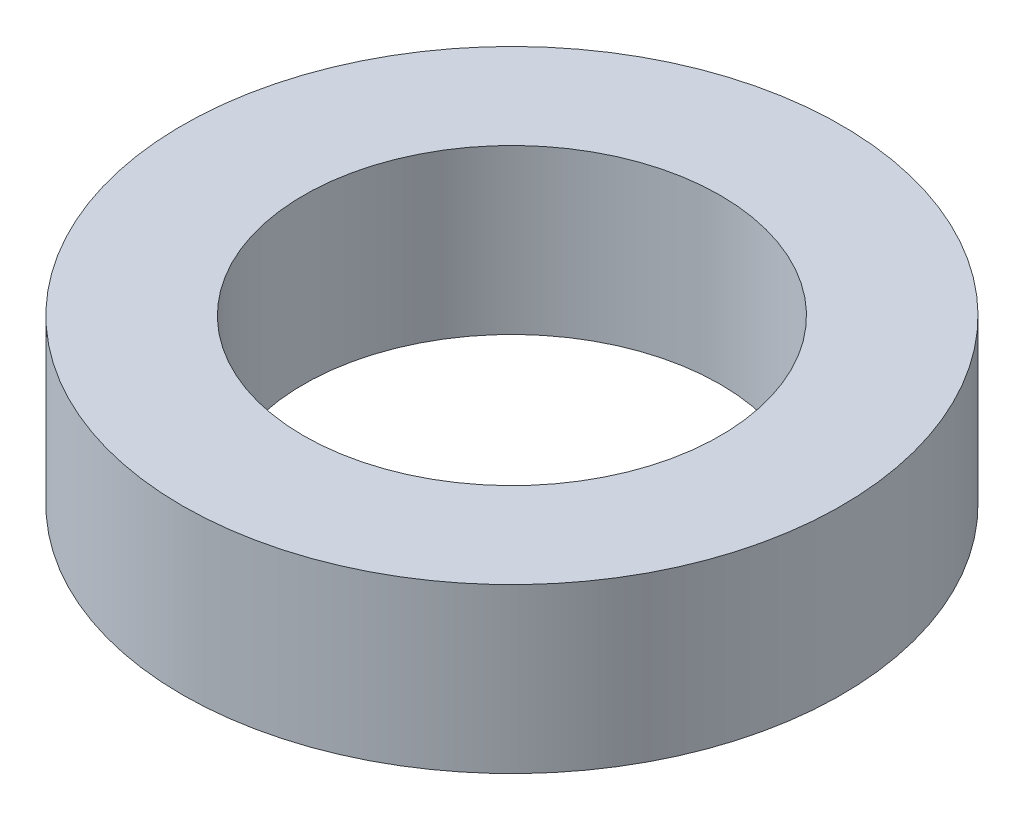
ISO-10303-21;
HEADER;
FILE_DESCRIPTION(('STEP AP214'),'2;1');
FILE_NAME('part.step','',(''),(''),'','','');
FILE_SCHEMA(('AUTOMOTIVE_DESIGN { 1 0 10303 214 1 1 1 1 }'));
ENDSEC;
DATA;
#1=APPLICATION_CONTEXT('core data for automotive mechanical design processes');
#2=APPLICATION_PROTOCOL_DEFINITION('international standard','automotive_design',2000,#1);
#3=PRODUCT_CONTEXT('',#1,'mechanical');
#4=PRODUCT('Part','Part','',(#3));
#5=PRODUCT_RELATED_PRODUCT_CATEGORY('part','',(#4));
#6=PRODUCT_DEFINITION_FORMATION('','',#4);
#7=PRODUCT_DEFINITION_CONTEXT('part definition',#1,'design');
#8=PRODUCT_DEFINITION('design','',#6,#7);
#9=PRODUCT_DEFINITION_SHAPE('','',#8);
#10=(LENGTH_UNIT() NAMED_UNIT(*) SI_UNIT(.MILLI.,.METRE.));
#11=(NAMED_UNIT(*) PLANE_ANGLE_UNIT() SI_UNIT($,.RADIAN.));
#12=(NAMED_UNIT(*) SI_UNIT($,.STERADIAN.) SOLID_ANGLE_UNIT());
#13=UNCERTAINTY_MEASURE_WITH_UNIT(LENGTH_MEASURE(1.E-05),#10,'distance_accuracy_value','');
#14=(GEOMETRIC_REPRESENTATION_CONTEXT(3) GLOBAL_UNCERTAINTY_ASSIGNED_CONTEXT((#13)) GLOBAL_UNIT_ASSIGNED_CONTEXT((#10,
#11,#12)) REPRESENTATION_CONTEXT('',''));
#15=CARTESIAN_POINT('',(0.,0.,0.));
#16=DIRECTION('',(0.,0.,1.));
#17=DIRECTION('',(1.,0.,0.));
#18=AXIS2_PLACEMENT_3D('',#15,#16,#17);
#19=CARTESIAN_POINT('',(0.,5.5,0.));
#20=DIRECTION('',(0.,-1.,0.));
#21=DIRECTION('',(0.,0.,-1.));
#22=AXIS2_PLACEMENT_3D('',#19,#20,#21);
#23=CYLINDRICAL_SURFACE('',#22,11.075);
#24=CARTESIAN_POINT('',(0.,5.5,0.));
#25=DIRECTION('',(0.,1.,0.));
#26=DIRECTION('',(0.,0.,1.));
#27=AXIS2_PLACEMENT_3D('',#24,#25,#26);
#28=CIRCLE('',#27,11.075);
#29=CARTESIAN_POINT('',(0.,5.5,11.075));
#30=VERTEX_POINT('',#29);
#31=EDGE_CURVE('E10',#30,#30,#28,.T.);
#32=ORIENTED_EDGE('',*,*,#31,.F.);
#33=EDGE_LOOP('',(#32));
#34=FACE_BOUND('',#33,.T.);
#35=CARTESIAN_POINT('',(0.,0.,0.));
#36=DIRECTION('',(0.,1.,0.));
#37=DIRECTION('',(0.,0.,1.));
#38=AXIS2_PLACEMENT_3D('',#35,#36,#37);
#39=CIRCLE('',#38,11.075);
#40=CARTESIAN_POINT('',(0.,0.,11.075));
#41=VERTEX_POINT('',#40);
#42=EDGE_CURVE('E42',#41,#41,#39,.T.);
#43=ORIENTED_EDGE('',*,*,#42,.T.);
#44=EDGE_LOOP('',(#43));
#45=FACE_BOUND('',#44,.T.);
#46=ADVANCED_FACE('F39',(#34,#45),#23,.T.);
#47=CARTESIAN_POINT('',(0.,5.5,0.));
#48=DIRECTION('',(0.,1.,0.));
#49=DIRECTION('',(0.,0.,1.));
#50=AXIS2_PLACEMENT_3D('',#47,#48,#49);
#51=PLANE('',#50);
#52=CARTESIAN_POINT('',(0.,5.5,0.));
#53=DIRECTION('',(0.,1.,0.));
#54=DIRECTION('',(0.,0.,1.));
#55=AXIS2_PLACEMENT_3D('',#52,#53,#54);
#56=CIRCLE('',#55,7.);
#57=CARTESIAN_POINT('',(0.,5.5,7.));
#58=VERTEX_POINT('',#57);
#59=EDGE_CURVE('E56',#58,#58,#56,.T.);
#60=ORIENTED_EDGE('',*,*,#59,.F.);
#61=EDGE_LOOP('',(#60));
#62=FACE_BOUND('',#61,.T.);
#63=ORIENTED_EDGE('',*,*,#31,.T.);
#64=EDGE_LOOP('',(#63));
#65=FACE_BOUND('',#64,.T.);
#66=ADVANCED_FACE('F63',(#62,#65),#51,.T.);
#67=CARTESIAN_POINT('',(0.,0.,0.));
#68=DIRECTION('',(0.,1.,0.));
#69=DIRECTION('',(0.,0.,1.));
#70=AXIS2_PLACEMENT_3D('',#67,#68,#69);
#71=PLANE('',#70);
#72=CARTESIAN_POINT('',(0.,0.,0.));
#73=DIRECTION('',(0.,1.,0.));
#74=DIRECTION('',(0.,0.,1.));
#75=AXIS2_PLACEMENT_3D('',#72,#73,#74);
#76=CIRCLE('',#75,7.);
#77=CARTESIAN_POINT('',(0.,0.,7.));
#78=VERTEX_POINT('',#77);
#79=EDGE_CURVE('E51',#78,#78,#76,.F.);
#80=ORIENTED_EDGE('',*,*,#79,.F.);
#81=EDGE_LOOP('',(#80));
#82=FACE_BOUND('',#81,.T.);
#83=ORIENTED_EDGE('',*,*,#42,.F.);
#84=EDGE_LOOP('',(#83));
#85=FACE_BOUND('',#84,.T.);
#86=ADVANCED_FACE('F65',(#82,#85),#71,.F.);
#87=CARTESIAN_POINT('',(0.,-19.7989898732233,0.));
#88=DIRECTION('',(0.,1.,0.));
#89=DIRECTION('',(0.,0.,1.));
#90=AXIS2_PLACEMENT_3D('',#87,#88,#89);
#91=CYLINDRICAL_SURFACE('',#90,7.);
#92=ORIENTED_EDGE('',*,*,#79,.T.);
#93=EDGE_LOOP('',(#92));
#94=FACE_BOUND('',#93,.T.);
#95=ORIENTED_EDGE('',*,*,#59,.T.);
#96=EDGE_LOOP('',(#95));
#97=FACE_BOUND('',#96,.T.);
#98=ADVANCED_FACE('F61',(#94,#97),#91,.F.);
#99=CLOSED_SHELL('',(#46,#66,#86,#98));
#100=MANIFOLD_SOLID_BREP('B2',#99);
#101=ADVANCED_BREP_SHAPE_REPRESENTATION('',(#18,#100),#14);
#102=SHAPE_DEFINITION_REPRESENTATION(#9,#101);
ENDSEC;
END-ISO-10303-21;
